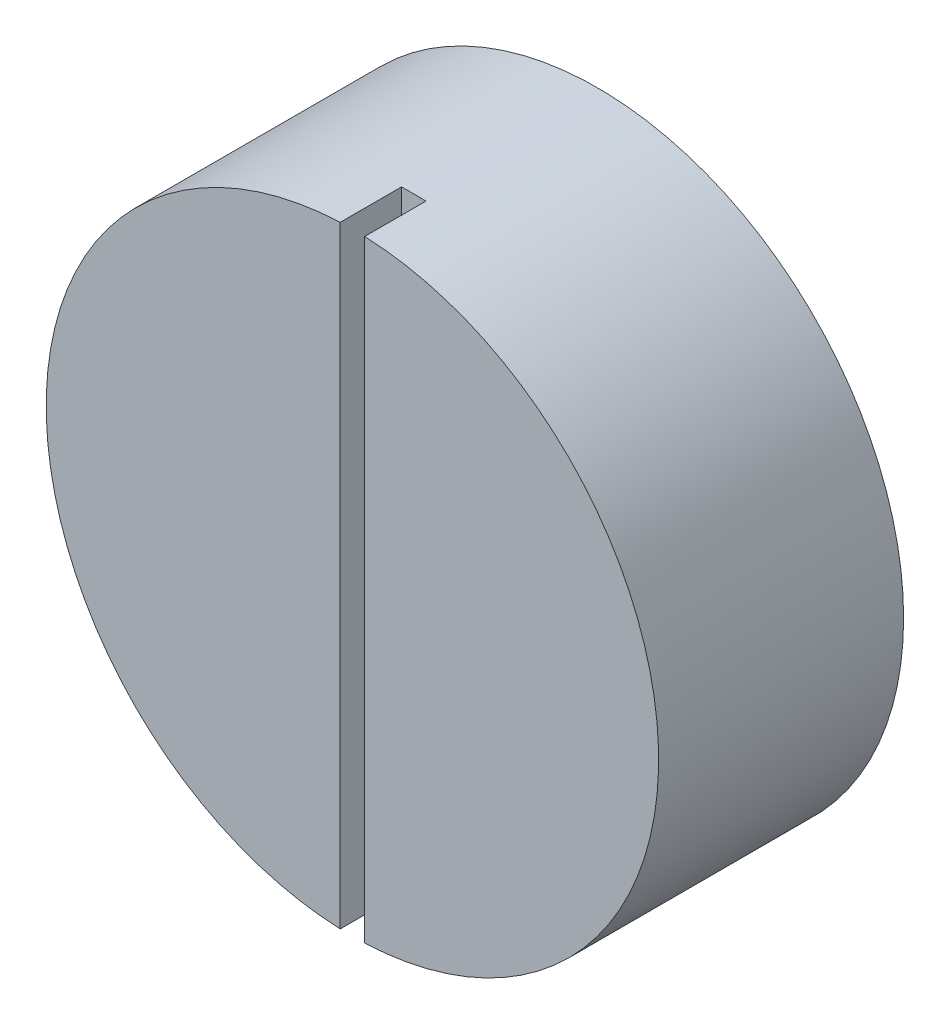
ISO-10303-21;
HEADER;
FILE_DESCRIPTION(('STEP AP214'),'2;1');
FILE_NAME('part.step','',(''),(''),'','','');
FILE_SCHEMA(('AUTOMOTIVE_DESIGN { 1 0 10303 214 1 1 1 1 }'));
ENDSEC;
DATA;
#1=APPLICATION_CONTEXT('core data for automotive mechanical design processes');
#2=APPLICATION_PROTOCOL_DEFINITION('international standard','automotive_design',2000,#1);
#3=PRODUCT_CONTEXT('',#1,'mechanical');
#4=PRODUCT('Part','Part','',(#3));
#5=PRODUCT_RELATED_PRODUCT_CATEGORY('part','',(#4));
#6=PRODUCT_DEFINITION_FORMATION('','',#4);
#7=PRODUCT_DEFINITION_CONTEXT('part definition',#1,'design');
#8=PRODUCT_DEFINITION('design','',#6,#7);
#9=PRODUCT_DEFINITION_SHAPE('','',#8);
#10=(LENGTH_UNIT() NAMED_UNIT(*) SI_UNIT(.MILLI.,.METRE.));
#11=(NAMED_UNIT(*) PLANE_ANGLE_UNIT() SI_UNIT($,.RADIAN.));
#12=(NAMED_UNIT(*) SI_UNIT($,.STERADIAN.) SOLID_ANGLE_UNIT());
#13=UNCERTAINTY_MEASURE_WITH_UNIT(LENGTH_MEASURE(1.E-05),#10,'distance_accuracy_value','');
#14=(GEOMETRIC_REPRESENTATION_CONTEXT(3) GLOBAL_UNCERTAINTY_ASSIGNED_CONTEXT((#13)) GLOBAL_UNIT_ASSIGNED_CONTEXT((#10,
#11,#12)) REPRESENTATION_CONTEXT('',''));
#15=CARTESIAN_POINT('',(0.,0.,0.));
#16=DIRECTION('',(0.,0.,1.));
#17=DIRECTION('',(1.,0.,0.));
#18=AXIS2_PLACEMENT_3D('',#15,#16,#17);
#19=CARTESIAN_POINT('',(0.,0.,20.));
#20=DIRECTION('',(0.,0.,1.));
#21=DIRECTION('',(1.,0.,0.));
#22=AXIS2_PLACEMENT_3D('',#19,#20,#21);
#23=PLANE('',#22);
#24=DIRECTION('',(0.,1.,0.));
#25=VECTOR('',#24,1.);
#26=CARTESIAN_POINT('',(1.,0.,20.));
#27=LINE('',#26,#25);
#28=CARTESIAN_POINT('',(1.,-24.9799919935936,20.));
#29=VERTEX_POINT('',#28);
#30=CARTESIAN_POINT('',(1.,24.9799919935936,20.));
#31=VERTEX_POINT('',#30);
#32=EDGE_CURVE('E82',#29,#31,#27,.T.);
#33=ORIENTED_EDGE('',*,*,#32,.F.);
#34=CARTESIAN_POINT('',(0.,0.,20.));
#35=DIRECTION('',(0.,0.,1.));
#36=DIRECTION('',(1.,0.,0.));
#37=AXIS2_PLACEMENT_3D('',#34,#35,#36);
#38=CIRCLE('',#37,25.);
#39=EDGE_CURVE('E92',#29,#31,#38,.T.);
#40=ORIENTED_EDGE('',*,*,#39,.T.);
#41=EDGE_LOOP('',(#33,#40));
#42=FACE_BOUND('',#41,.T.);
#43=ADVANCED_FACE('F34',(#42),#23,.T.);
#44=CARTESIAN_POINT('',(0.,0.,20.));
#45=DIRECTION('',(0.,0.,-1.));
#46=DIRECTION('',(-1.,0.,0.));
#47=AXIS2_PLACEMENT_3D('',#44,#45,#46);
#48=CYLINDRICAL_SURFACE('',#47,25.);
#49=CARTESIAN_POINT('',(0.,0.,15.));
#50=DIRECTION('',(0.,0.,-1.));
#51=DIRECTION('',(-1.,0.,0.));
#52=AXIS2_PLACEMENT_3D('',#49,#50,#51);
#53=CIRCLE('',#52,25.);
#54=CARTESIAN_POINT('',(-1.,24.9799919935936,15.));
#55=VERTEX_POINT('',#54);
#56=CARTESIAN_POINT('',(1.,24.9799919935936,15.));
#57=VERTEX_POINT('',#56);
#58=EDGE_CURVE('E11',#55,#57,#53,.T.);
#59=ORIENTED_EDGE('',*,*,#58,.T.);
#60=DIRECTION('',(0.,0.,-1.));
#61=VECTOR('',#60,1.);
#62=CARTESIAN_POINT('',(1.,24.9799919935936,20.));
#63=LINE('',#62,#61);
#64=EDGE_CURVE('E57',#57,#31,#63,.F.);
#65=ORIENTED_EDGE('',*,*,#64,.T.);
#66=ORIENTED_EDGE('',*,*,#39,.F.);
#67=DIRECTION('',(0.,0.,-1.));
#68=VECTOR('',#67,1.);
#69=CARTESIAN_POINT('',(1.,-24.9799919935936,20.));
#70=LINE('',#69,#68);
#71=CARTESIAN_POINT('',(1.,-24.9799919935936,15.));
#72=VERTEX_POINT('',#71);
#73=EDGE_CURVE('E98',#29,#72,#70,.T.);
#74=ORIENTED_EDGE('',*,*,#73,.T.);
#75=CARTESIAN_POINT('',(-1.,-24.9799919935936,15.));
#76=VERTEX_POINT('',#75);
#77=EDGE_CURVE('E38',#72,#76,#53,.T.);
#78=ORIENTED_EDGE('',*,*,#77,.T.);
#79=DIRECTION('',(0.,0.,-1.));
#80=VECTOR('',#79,1.);
#81=CARTESIAN_POINT('',(-1.,-24.9799919935936,20.));
#82=LINE('',#81,#80);
#83=CARTESIAN_POINT('',(-1.,-24.9799919935936,20.));
#84=VERTEX_POINT('',#83);
#85=EDGE_CURVE('E77',#76,#84,#82,.F.);
#86=ORIENTED_EDGE('',*,*,#85,.T.);
#87=CARTESIAN_POINT('',(-1.,24.9799919935936,20.));
#88=VERTEX_POINT('',#87);
#89=EDGE_CURVE('E83',#88,#84,#38,.T.);
#90=ORIENTED_EDGE('',*,*,#89,.F.);
#91=DIRECTION('',(0.,0.,-1.));
#92=VECTOR('',#91,1.);
#93=CARTESIAN_POINT('',(-1.,24.9799919935936,20.));
#94=LINE('',#93,#92);
#95=EDGE_CURVE('E49',#88,#55,#94,.T.);
#96=ORIENTED_EDGE('',*,*,#95,.T.);
#97=EDGE_LOOP('',(#59,#65,#66,#74,#78,#86,#90,#96));
#98=FACE_BOUND('',#97,.T.);
#99=CARTESIAN_POINT('',(0.,0.,0.));
#100=DIRECTION('',(0.,0.,1.));
#101=DIRECTION('',(1.,0.,0.));
#102=AXIS2_PLACEMENT_3D('',#99,#100,#101);
#103=CIRCLE('',#102,25.);
#104=CARTESIAN_POINT('',(25.,0.,0.));
#105=VERTEX_POINT('',#104);
#106=EDGE_CURVE('E95',#105,#105,#103,.T.);
#107=ORIENTED_EDGE('',*,*,#106,.T.);
#108=EDGE_LOOP('',(#107));
#109=FACE_BOUND('',#108,.T.);
#110=ADVANCED_FACE('F36',(#98,#109),#48,.T.);
#111=DIRECTION('',(0.,-1.,0.));
#112=VECTOR('',#111,1.);
#113=CARTESIAN_POINT('',(-1.,0.,20.));
#114=LINE('',#113,#112);
#115=EDGE_CURVE('E74',#88,#84,#114,.T.);
#116=ORIENTED_EDGE('',*,*,#115,.F.);
#117=ORIENTED_EDGE('',*,*,#89,.T.);
#118=EDGE_LOOP('',(#116,#117));
#119=FACE_BOUND('',#118,.T.);
#120=ADVANCED_FACE('F91',(#119),#23,.T.);
#121=CARTESIAN_POINT('',(0.,0.,0.));
#122=DIRECTION('',(0.,0.,1.));
#123=DIRECTION('',(1.,0.,0.));
#124=AXIS2_PLACEMENT_3D('',#121,#122,#123);
#125=PLANE('',#124);
#126=ORIENTED_EDGE('',*,*,#106,.F.);
#127=EDGE_LOOP('',(#126));
#128=FACE_BOUND('',#127,.T.);
#129=ADVANCED_FACE('F112',(#128),#125,.F.);
#130=CARTESIAN_POINT('',(0.,0.,15.));
#131=DIRECTION('',(0.,0.,-1.));
#132=DIRECTION('',(-1.,0.,0.));
#133=AXIS2_PLACEMENT_3D('',#130,#131,#132);
#134=PLANE('',#133);
#135=DIRECTION('',(0.,-1.,0.));
#136=VECTOR('',#135,1.);
#137=CARTESIAN_POINT('',(-1.,25.,15.));
#138=LINE('',#137,#136);
#139=EDGE_CURVE('E89',#55,#76,#138,.T.);
#140=ORIENTED_EDGE('',*,*,#139,.T.);
#141=ORIENTED_EDGE('',*,*,#77,.F.);
#142=DIRECTION('',(0.,1.,0.));
#143=VECTOR('',#142,1.);
#144=CARTESIAN_POINT('',(1.,25.,15.));
#145=LINE('',#144,#143);
#146=EDGE_CURVE('E163',#72,#57,#145,.T.);
#147=ORIENTED_EDGE('',*,*,#146,.T.);
#148=ORIENTED_EDGE('',*,*,#58,.F.);
#149=EDGE_LOOP('',(#140,#141,#147,#148));
#150=FACE_BOUND('',#149,.T.);
#151=ADVANCED_FACE('F116',(#150),#134,.F.);
#152=CARTESIAN_POINT('',(1.,25.,15.));
#153=DIRECTION('',(1.,0.,0.));
#154=DIRECTION('',(0.,0.,-1.));
#155=AXIS2_PLACEMENT_3D('',#152,#153,#154);
#156=PLANE('',#155);
#157=ORIENTED_EDGE('',*,*,#32,.T.);
#158=ORIENTED_EDGE('',*,*,#64,.F.);
#159=ORIENTED_EDGE('',*,*,#146,.F.);
#160=ORIENTED_EDGE('',*,*,#73,.F.);
#161=EDGE_LOOP('',(#157,#158,#159,#160));
#162=FACE_BOUND('',#161,.T.);
#163=ADVANCED_FACE('F102',(#162),#156,.F.);
#164=CARTESIAN_POINT('',(-1.,25.,15.));
#165=DIRECTION('',(-1.,0.,0.));
#166=DIRECTION('',(0.,0.,1.));
#167=AXIS2_PLACEMENT_3D('',#164,#165,#166);
#168=PLANE('',#167);
#169=ORIENTED_EDGE('',*,*,#115,.T.);
#170=ORIENTED_EDGE('',*,*,#85,.F.);
#171=ORIENTED_EDGE('',*,*,#139,.F.);
#172=ORIENTED_EDGE('',*,*,#95,.F.);
#173=EDGE_LOOP('',(#169,#170,#171,#172));
#174=FACE_BOUND('',#173,.T.);
#175=ADVANCED_FACE('F76',(#174),#168,.F.);
#176=CLOSED_SHELL('',(#43,#110,#120,#129,#151,#163,#175));
#177=MANIFOLD_SOLID_BREP('B2',#176);
#178=ADVANCED_BREP_SHAPE_REPRESENTATION('',(#18,#177),#14);
#179=SHAPE_DEFINITION_REPRESENTATION(#9,#178);
ENDSEC;
END-ISO-10303-21;
